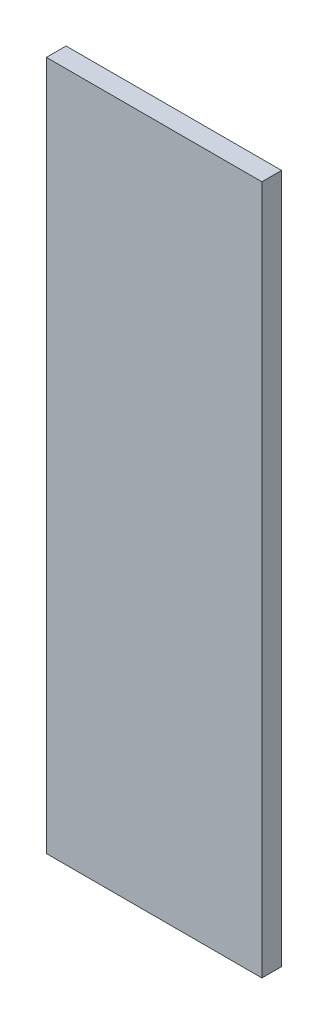
ISO-10303-21;
HEADER;
FILE_DESCRIPTION(('STEP AP214'),'2;1');
FILE_NAME('part.step','',(''),(''),'','','');
FILE_SCHEMA(('AUTOMOTIVE_DESIGN { 1 0 10303 214 1 1 1 1 }'));
ENDSEC;
DATA;
#1=APPLICATION_CONTEXT('core data for automotive mechanical design processes');
#2=APPLICATION_PROTOCOL_DEFINITION('international standard','automotive_design',2000,#1);
#3=PRODUCT_CONTEXT('',#1,'mechanical');
#4=PRODUCT('Part','Part','',(#3));
#5=PRODUCT_RELATED_PRODUCT_CATEGORY('part','',(#4));
#6=PRODUCT_DEFINITION_FORMATION('','',#4);
#7=PRODUCT_DEFINITION_CONTEXT('part definition',#1,'design');
#8=PRODUCT_DEFINITION('design','',#6,#7);
#9=PRODUCT_DEFINITION_SHAPE('','',#8);
#10=(LENGTH_UNIT() NAMED_UNIT(*) SI_UNIT(.MILLI.,.METRE.));
#11=(NAMED_UNIT(*) PLANE_ANGLE_UNIT() SI_UNIT($,.RADIAN.));
#12=(NAMED_UNIT(*) SI_UNIT($,.STERADIAN.) SOLID_ANGLE_UNIT());
#13=UNCERTAINTY_MEASURE_WITH_UNIT(LENGTH_MEASURE(1.E-05),#10,'distance_accuracy_value','');
#14=(GEOMETRIC_REPRESENTATION_CONTEXT(3) GLOBAL_UNCERTAINTY_ASSIGNED_CONTEXT((#13)) GLOBAL_UNIT_ASSIGNED_CONTEXT((#10,
#11,#12)) REPRESENTATION_CONTEXT('',''));
#15=CARTESIAN_POINT('',(0.,0.,0.));
#16=DIRECTION('',(0.,0.,1.));
#17=DIRECTION('',(1.,0.,0.));
#18=AXIS2_PLACEMENT_3D('',#15,#16,#17);
#19=CARTESIAN_POINT('',(357.664513315744,90.6213415488749,-6.35));
#20=DIRECTION('',(-1.,0.,0.));
#21=DIRECTION('',(0.,-1.,0.));
#22=AXIS2_PLACEMENT_3D('',#19,#20,#21);
#23=PLANE('',#22);
#24=DIRECTION('',(0.,-1.,0.));
#25=VECTOR('',#24,1.);
#26=CARTESIAN_POINT('',(357.664513315744,90.6213415488749,0.));
#27=LINE('',#26,#25);
#28=CARTESIAN_POINT('',(357.664513315744,90.6213415488749,0.));
#29=VERTEX_POINT('',#28);
#30=CARTESIAN_POINT('',(357.664513315745,-131.778658451125,0.));
#31=VERTEX_POINT('',#30);
#32=EDGE_CURVE('E97',#29,#31,#27,.T.);
#33=ORIENTED_EDGE('',*,*,#32,.F.);
#34=DIRECTION('',(0.,0.,1.));
#35=VECTOR('',#34,1.);
#36=CARTESIAN_POINT('',(357.664513315744,90.6213415488749,-6.35));
#37=LINE('',#36,#35);
#38=CARTESIAN_POINT('',(357.664513315744,90.6213415488749,-6.35));
#39=VERTEX_POINT('',#38);
#40=EDGE_CURVE('E11',#39,#29,#37,.T.);
#41=ORIENTED_EDGE('',*,*,#40,.F.);
#42=DIRECTION('',(0.,-1.,0.));
#43=VECTOR('',#42,1.);
#44=CARTESIAN_POINT('',(357.664513315744,90.6213415488749,-6.35));
#45=LINE('',#44,#43);
#46=CARTESIAN_POINT('',(357.664513315745,-131.778658451125,-6.35));
#47=VERTEX_POINT('',#46);
#48=EDGE_CURVE('E91',#39,#47,#45,.T.);
#49=ORIENTED_EDGE('',*,*,#48,.T.);
#50=DIRECTION('',(0.,0.,1.));
#51=VECTOR('',#50,1.);
#52=CARTESIAN_POINT('',(357.664513315745,-131.778658451125,-6.35));
#53=LINE('',#52,#51);
#54=EDGE_CURVE('E36',#47,#31,#53,.T.);
#55=ORIENTED_EDGE('',*,*,#54,.T.);
#56=EDGE_LOOP('',(#33,#41,#49,#55));
#57=FACE_BOUND('',#56,.T.);
#58=ADVANCED_FACE('F33',(#57),#23,.T.);
#59=CARTESIAN_POINT('',(357.664513315744,90.6213415488749,-6.35));
#60=DIRECTION('',(0.,1.,0.));
#61=DIRECTION('',(0.,0.,1.));
#62=AXIS2_PLACEMENT_3D('',#59,#60,#61);
#63=PLANE('',#62);
#64=DIRECTION('',(-1.,0.,0.));
#65=VECTOR('',#64,1.);
#66=CARTESIAN_POINT('',(357.664513315744,90.6213415488749,0.));
#67=LINE('',#66,#65);
#68=CARTESIAN_POINT('',(427.164513315744,90.6213415488749,0.));
#69=VERTEX_POINT('',#68);
#70=EDGE_CURVE('E93',#69,#29,#67,.T.);
#71=ORIENTED_EDGE('',*,*,#70,.F.);
#72=DIRECTION('',(0.,0.,1.));
#73=VECTOR('',#72,1.);
#74=CARTESIAN_POINT('',(427.164513315744,90.6213415488749,-6.35));
#75=LINE('',#74,#73);
#76=CARTESIAN_POINT('',(427.164513315744,90.6213415488749,-6.35));
#77=VERTEX_POINT('',#76);
#78=EDGE_CURVE('E42',#77,#69,#75,.T.);
#79=ORIENTED_EDGE('',*,*,#78,.F.);
#80=DIRECTION('',(-1.,0.,0.));
#81=VECTOR('',#80,1.);
#82=CARTESIAN_POINT('',(357.664513315744,90.6213415488749,-6.35));
#83=LINE('',#82,#81);
#84=EDGE_CURVE('E88',#77,#39,#83,.T.);
#85=ORIENTED_EDGE('',*,*,#84,.T.);
#86=ORIENTED_EDGE('',*,*,#40,.T.);
#87=EDGE_LOOP('',(#71,#79,#85,#86));
#88=FACE_BOUND('',#87,.T.);
#89=ADVANCED_FACE('F107',(#88),#63,.T.);
#90=CARTESIAN_POINT('',(427.164513315744,90.6213415488749,-6.35));
#91=DIRECTION('',(1.,0.,0.));
#92=DIRECTION('',(0.,0.,-1.));
#93=AXIS2_PLACEMENT_3D('',#90,#91,#92);
#94=PLANE('',#93);
#95=DIRECTION('',(0.,1.,0.));
#96=VECTOR('',#95,1.);
#97=CARTESIAN_POINT('',(427.164513315744,90.6213415488749,0.));
#98=LINE('',#97,#96);
#99=CARTESIAN_POINT('',(427.164513315744,-131.778658451125,0.));
#100=VERTEX_POINT('',#99);
#101=EDGE_CURVE('E83',#100,#69,#98,.T.);
#102=ORIENTED_EDGE('',*,*,#101,.F.);
#103=DIRECTION('',(0.,0.,1.));
#104=VECTOR('',#103,1.);
#105=CARTESIAN_POINT('',(427.164513315744,-131.778658451125,-6.35));
#106=LINE('',#105,#104);
#107=CARTESIAN_POINT('',(427.164513315744,-131.778658451125,-6.35));
#108=VERTEX_POINT('',#107);
#109=EDGE_CURVE('E78',#108,#100,#106,.T.);
#110=ORIENTED_EDGE('',*,*,#109,.F.);
#111=DIRECTION('',(0.,1.,0.));
#112=VECTOR('',#111,1.);
#113=CARTESIAN_POINT('',(427.164513315744,90.6213415488749,-6.35));
#114=LINE('',#113,#112);
#115=EDGE_CURVE('E81',#108,#77,#114,.T.);
#116=ORIENTED_EDGE('',*,*,#115,.T.);
#117=ORIENTED_EDGE('',*,*,#78,.T.);
#118=EDGE_LOOP('',(#102,#110,#116,#117));
#119=FACE_BOUND('',#118,.T.);
#120=ADVANCED_FACE('F80',(#119),#94,.T.);
#121=CARTESIAN_POINT('',(357.664513315745,-131.778658451125,-6.35));
#122=DIRECTION('',(0.,-1.,0.));
#123=DIRECTION('',(0.,0.,-1.));
#124=AXIS2_PLACEMENT_3D('',#121,#122,#123);
#125=PLANE('',#124);
#126=DIRECTION('',(1.,0.,0.));
#127=VECTOR('',#126,1.);
#128=CARTESIAN_POINT('',(357.664513315745,-131.778658451125,0.));
#129=LINE('',#128,#127);
#130=EDGE_CURVE('E100',#31,#100,#129,.T.);
#131=ORIENTED_EDGE('',*,*,#130,.F.);
#132=ORIENTED_EDGE('',*,*,#54,.F.);
#133=DIRECTION('',(1.,0.,0.));
#134=VECTOR('',#133,1.);
#135=CARTESIAN_POINT('',(357.664513315745,-131.778658451125,-6.35));
#136=LINE('',#135,#134);
#137=EDGE_CURVE('E87',#47,#108,#136,.T.);
#138=ORIENTED_EDGE('',*,*,#137,.T.);
#139=ORIENTED_EDGE('',*,*,#109,.T.);
#140=EDGE_LOOP('',(#131,#132,#138,#139));
#141=FACE_BOUND('',#140,.T.);
#142=ADVANCED_FACE('F90',(#141),#125,.T.);
#143=CARTESIAN_POINT('',(0.,0.,-6.35));
#144=DIRECTION('',(0.,0.,1.));
#145=DIRECTION('',(1.,0.,0.));
#146=AXIS2_PLACEMENT_3D('',#143,#144,#145);
#147=PLANE('',#146);
#148=ORIENTED_EDGE('',*,*,#48,.F.);
#149=ORIENTED_EDGE('',*,*,#84,.F.);
#150=ORIENTED_EDGE('',*,*,#115,.F.);
#151=ORIENTED_EDGE('',*,*,#137,.F.);
#152=EDGE_LOOP('',(#148,#149,#150,#151));
#153=FACE_BOUND('',#152,.T.);
#154=ADVANCED_FACE('F86',(#153),#147,.F.);
#155=CARTESIAN_POINT('',(0.,0.,0.));
#156=DIRECTION('',(0.,0.,1.));
#157=DIRECTION('',(1.,0.,0.));
#158=AXIS2_PLACEMENT_3D('',#155,#156,#157);
#159=PLANE('',#158);
#160=ORIENTED_EDGE('',*,*,#32,.T.);
#161=ORIENTED_EDGE('',*,*,#130,.T.);
#162=ORIENTED_EDGE('',*,*,#101,.T.);
#163=ORIENTED_EDGE('',*,*,#70,.T.);
#164=EDGE_LOOP('',(#160,#161,#162,#163));
#165=FACE_BOUND('',#164,.T.);
#166=ADVANCED_FACE('F106',(#165),#159,.T.);
#167=CLOSED_SHELL('',(#58,#89,#120,#142,#154,#166));
#168=MANIFOLD_SOLID_BREP('B2',#167);
#169=ADVANCED_BREP_SHAPE_REPRESENTATION('',(#18,#168),#14);
#170=SHAPE_DEFINITION_REPRESENTATION(#9,#169);
ENDSEC;
END-ISO-10303-21;
